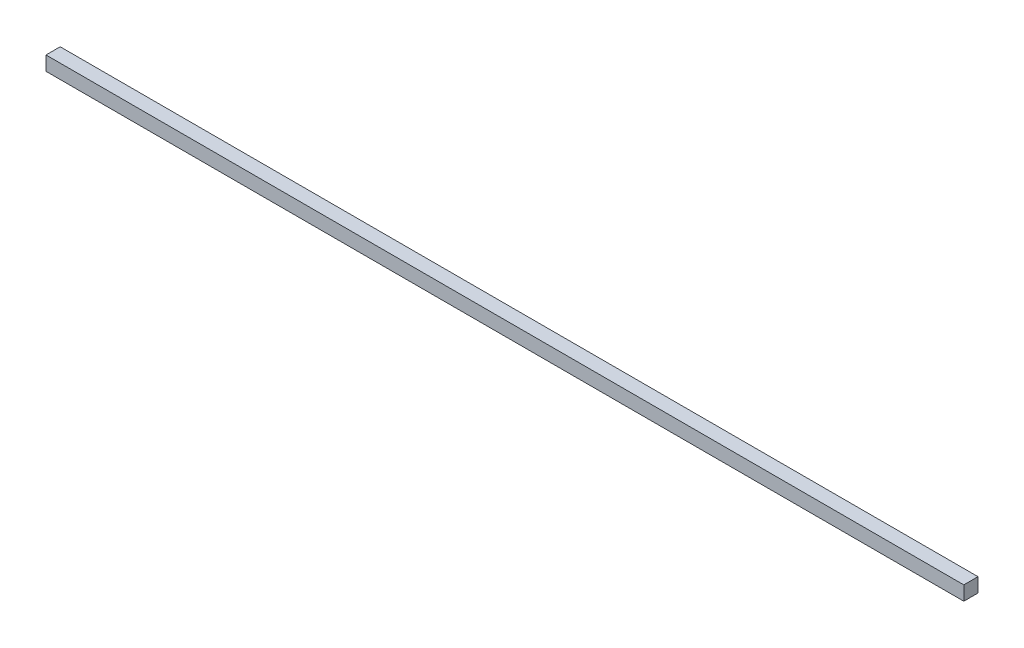
ISO-10303-21;
HEADER;
FILE_DESCRIPTION(('STEP AP214'),'2;1');
FILE_NAME('part.step','',(''),(''),'','','');
FILE_SCHEMA(('AUTOMOTIVE_DESIGN { 1 0 10303 214 1 1 1 1 }'));
ENDSEC;
DATA;
#1=APPLICATION_CONTEXT('core data for automotive mechanical design processes');
#2=APPLICATION_PROTOCOL_DEFINITION('international standard','automotive_design',2000,#1);
#3=PRODUCT_CONTEXT('',#1,'mechanical');
#4=PRODUCT('Part','Part','',(#3));
#5=PRODUCT_RELATED_PRODUCT_CATEGORY('part','',(#4));
#6=PRODUCT_DEFINITION_FORMATION('','',#4);
#7=PRODUCT_DEFINITION_CONTEXT('part definition',#1,'design');
#8=PRODUCT_DEFINITION('design','',#6,#7);
#9=PRODUCT_DEFINITION_SHAPE('','',#8);
#10=(LENGTH_UNIT() NAMED_UNIT(*) SI_UNIT(.MILLI.,.METRE.));
#11=(NAMED_UNIT(*) PLANE_ANGLE_UNIT() SI_UNIT($,.RADIAN.));
#12=(NAMED_UNIT(*) SI_UNIT($,.STERADIAN.) SOLID_ANGLE_UNIT());
#13=UNCERTAINTY_MEASURE_WITH_UNIT(LENGTH_MEASURE(1.E-05),#10,'distance_accuracy_value','');
#14=(GEOMETRIC_REPRESENTATION_CONTEXT(3) GLOBAL_UNCERTAINTY_ASSIGNED_CONTEXT((#13)) GLOBAL_UNIT_ASSIGNED_CONTEXT((#10,
#11,#12)) REPRESENTATION_CONTEXT('',''));
#15=CARTESIAN_POINT('',(0.,0.,0.));
#16=DIRECTION('',(0.,0.,1.));
#17=DIRECTION('',(1.,0.,0.));
#18=AXIS2_PLACEMENT_3D('',#15,#16,#17);
#19=CARTESIAN_POINT('',(-307.975,0.,0.));
#20=DIRECTION('',(0.,-1.,0.));
#21=DIRECTION('',(0.,0.,1.));
#22=AXIS2_PLACEMENT_3D('',#19,#20,#21);
#23=PLANE('',#22);
#24=DIRECTION('',(0.,0.,1.));
#25=VECTOR('',#24,1.);
#26=CARTESIAN_POINT('',(0.,0.,0.));
#27=LINE('',#26,#25);
#28=CARTESIAN_POINT('',(0.,0.,0.));
#29=VERTEX_POINT('',#28);
#30=CARTESIAN_POINT('',(0.,0.,4.7625));
#31=VERTEX_POINT('',#30);
#32=EDGE_CURVE('E105',#29,#31,#27,.T.);
#33=ORIENTED_EDGE('',*,*,#32,.T.);
#34=DIRECTION('',(1.,0.,0.));
#35=VECTOR('',#34,1.);
#36=CARTESIAN_POINT('',(-307.975,0.,4.7625));
#37=LINE('',#36,#35);
#38=CARTESIAN_POINT('',(-307.975,0.,4.7625));
#39=VERTEX_POINT('',#38);
#40=EDGE_CURVE('E44',#39,#31,#37,.T.);
#41=ORIENTED_EDGE('',*,*,#40,.F.);
#42=DIRECTION('',(0.,0.,1.));
#43=VECTOR('',#42,1.);
#44=CARTESIAN_POINT('',(-307.975,0.,0.));
#45=LINE('',#44,#43);
#46=CARTESIAN_POINT('',(-307.975,0.,0.));
#47=VERTEX_POINT('',#46);
#48=EDGE_CURVE('E94',#47,#39,#45,.T.);
#49=ORIENTED_EDGE('',*,*,#48,.F.);
#50=DIRECTION('',(1.,0.,0.));
#51=VECTOR('',#50,1.);
#52=CARTESIAN_POINT('',(-307.975,0.,0.));
#53=LINE('',#52,#51);
#54=EDGE_CURVE('E11',#47,#29,#53,.T.);
#55=ORIENTED_EDGE('',*,*,#54,.T.);
#56=EDGE_LOOP('',(#33,#41,#49,#55));
#57=FACE_BOUND('',#56,.T.);
#58=ADVANCED_FACE('F41',(#57),#23,.T.);
#59=CARTESIAN_POINT('',(-307.975,0.,0.));
#60=DIRECTION('',(0.,0.,1.));
#61=DIRECTION('',(-1.,0.,0.));
#62=AXIS2_PLACEMENT_3D('',#59,#60,#61);
#63=PLANE('',#62);
#64=DIRECTION('',(0.,1.,0.));
#65=VECTOR('',#64,1.);
#66=CARTESIAN_POINT('',(0.,0.,0.));
#67=LINE('',#66,#65);
#68=CARTESIAN_POINT('',(0.,4.7625,0.));
#69=VERTEX_POINT('',#68);
#70=EDGE_CURVE('E82',#29,#69,#67,.T.);
#71=ORIENTED_EDGE('',*,*,#70,.F.);
#72=ORIENTED_EDGE('',*,*,#54,.F.);
#73=DIRECTION('',(0.,1.,0.));
#74=VECTOR('',#73,1.);
#75=CARTESIAN_POINT('',(-307.975,0.,0.));
#76=LINE('',#75,#74);
#77=CARTESIAN_POINT('',(-307.975,4.7625,0.));
#78=VERTEX_POINT('',#77);
#79=EDGE_CURVE('E59',#47,#78,#76,.T.);
#80=ORIENTED_EDGE('',*,*,#79,.T.);
#81=DIRECTION('',(1.,0.,0.));
#82=VECTOR('',#81,1.);
#83=CARTESIAN_POINT('',(-307.975,4.7625,0.));
#84=LINE('',#83,#82);
#85=EDGE_CURVE('E50',#78,#69,#84,.T.);
#86=ORIENTED_EDGE('',*,*,#85,.T.);
#87=EDGE_LOOP('',(#71,#72,#80,#86));
#88=FACE_BOUND('',#87,.T.);
#89=ADVANCED_FACE('F111',(#88),#63,.F.);
#90=CARTESIAN_POINT('',(-307.975,4.7625,0.));
#91=DIRECTION('',(0.,-1.,0.));
#92=DIRECTION('',(0.,0.,1.));
#93=AXIS2_PLACEMENT_3D('',#90,#91,#92);
#94=PLANE('',#93);
#95=DIRECTION('',(0.,0.,1.));
#96=VECTOR('',#95,1.);
#97=CARTESIAN_POINT('',(0.,4.7625,0.));
#98=LINE('',#97,#96);
#99=CARTESIAN_POINT('',(0.,4.7625,4.7625));
#100=VERTEX_POINT('',#99);
#101=EDGE_CURVE('E76',#69,#100,#98,.T.);
#102=ORIENTED_EDGE('',*,*,#101,.F.);
#103=ORIENTED_EDGE('',*,*,#85,.F.);
#104=DIRECTION('',(0.,0.,1.));
#105=VECTOR('',#104,1.);
#106=CARTESIAN_POINT('',(-307.975,4.7625,0.));
#107=LINE('',#106,#105);
#108=CARTESIAN_POINT('',(-307.975,4.7625,4.7625));
#109=VERTEX_POINT('',#108);
#110=EDGE_CURVE('E92',#78,#109,#107,.T.);
#111=ORIENTED_EDGE('',*,*,#110,.T.);
#112=DIRECTION('',(1.,0.,0.));
#113=VECTOR('',#112,1.);
#114=CARTESIAN_POINT('',(-307.975,4.7625,4.7625));
#115=LINE('',#114,#113);
#116=EDGE_CURVE('E97',#109,#100,#115,.T.);
#117=ORIENTED_EDGE('',*,*,#116,.T.);
#118=EDGE_LOOP('',(#102,#103,#111,#117));
#119=FACE_BOUND('',#118,.T.);
#120=ADVANCED_FACE('F100',(#119),#94,.F.);
#121=CARTESIAN_POINT('',(-307.975,0.,4.7625));
#122=DIRECTION('',(0.,0.,1.));
#123=DIRECTION('',(-1.,0.,0.));
#124=AXIS2_PLACEMENT_3D('',#121,#122,#123);
#125=PLANE('',#124);
#126=DIRECTION('',(0.,1.,0.));
#127=VECTOR('',#126,1.);
#128=CARTESIAN_POINT('',(0.,0.,4.7625));
#129=LINE('',#128,#127);
#130=EDGE_CURVE('E99',#31,#100,#129,.T.);
#131=ORIENTED_EDGE('',*,*,#130,.T.);
#132=ORIENTED_EDGE('',*,*,#116,.F.);
#133=DIRECTION('',(0.,1.,0.));
#134=VECTOR('',#133,1.);
#135=CARTESIAN_POINT('',(-307.975,0.,4.7625));
#136=LINE('',#135,#134);
#137=EDGE_CURVE('E89',#39,#109,#136,.T.);
#138=ORIENTED_EDGE('',*,*,#137,.F.);
#139=ORIENTED_EDGE('',*,*,#40,.T.);
#140=EDGE_LOOP('',(#131,#132,#138,#139));
#141=FACE_BOUND('',#140,.T.);
#142=ADVANCED_FACE('F98',(#141),#125,.T.);
#143=CARTESIAN_POINT('',(-307.975,0.,0.));
#144=DIRECTION('',(1.,0.,0.));
#145=DIRECTION('',(0.,0.,1.));
#146=AXIS2_PLACEMENT_3D('',#143,#144,#145);
#147=PLANE('',#146);
#148=ORIENTED_EDGE('',*,*,#48,.T.);
#149=ORIENTED_EDGE('',*,*,#137,.T.);
#150=ORIENTED_EDGE('',*,*,#110,.F.);
#151=ORIENTED_EDGE('',*,*,#79,.F.);
#152=EDGE_LOOP('',(#148,#149,#150,#151));
#153=FACE_BOUND('',#152,.T.);
#154=ADVANCED_FACE('F90',(#153),#147,.F.);
#155=CARTESIAN_POINT('',(0.,0.,0.));
#156=DIRECTION('',(1.,0.,0.));
#157=DIRECTION('',(0.,0.,1.));
#158=AXIS2_PLACEMENT_3D('',#155,#156,#157);
#159=PLANE('',#158);
#160=ORIENTED_EDGE('',*,*,#32,.F.);
#161=ORIENTED_EDGE('',*,*,#70,.T.);
#162=ORIENTED_EDGE('',*,*,#101,.T.);
#163=ORIENTED_EDGE('',*,*,#130,.F.);
#164=EDGE_LOOP('',(#160,#161,#162,#163));
#165=FACE_BOUND('',#164,.T.);
#166=ADVANCED_FACE('F114',(#165),#159,.T.);
#167=CLOSED_SHELL('',(#58,#89,#120,#142,#154,#166));
#168=MANIFOLD_SOLID_BREP('B2',#167);
#169=ADVANCED_BREP_SHAPE_REPRESENTATION('',(#18,#168),#14);
#170=SHAPE_DEFINITION_REPRESENTATION(#9,#169);
ENDSEC;
END-ISO-10303-21;
